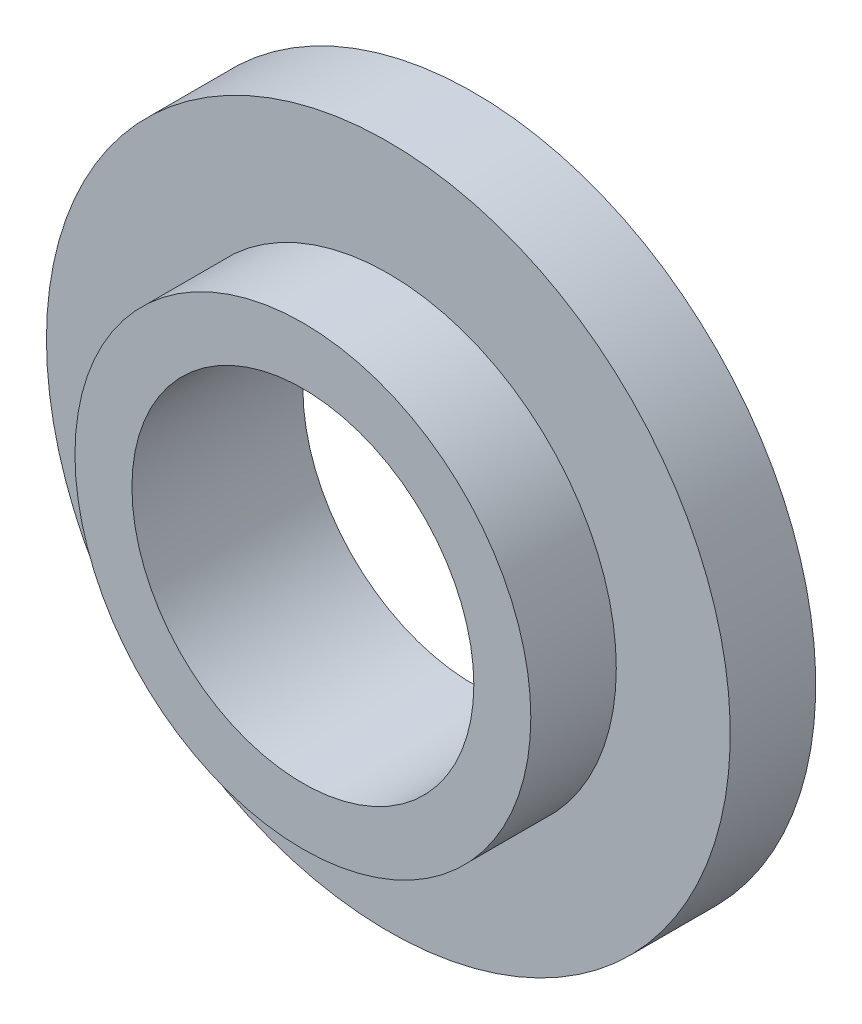
ISO-10303-21;
HEADER;
FILE_DESCRIPTION(('STEP AP214'),'2;1');
FILE_NAME('part.step','',(''),(''),'','','');
FILE_SCHEMA(('AUTOMOTIVE_DESIGN { 1 0 10303 214 1 1 1 1 }'));
ENDSEC;
DATA;
#1=APPLICATION_CONTEXT('core data for automotive mechanical design processes');
#2=APPLICATION_PROTOCOL_DEFINITION('international standard','automotive_design',2000,#1);
#3=PRODUCT_CONTEXT('',#1,'mechanical');
#4=PRODUCT('Part','Part','',(#3));
#5=PRODUCT_RELATED_PRODUCT_CATEGORY('part','',(#4));
#6=PRODUCT_DEFINITION_FORMATION('','',#4);
#7=PRODUCT_DEFINITION_CONTEXT('part definition',#1,'design');
#8=PRODUCT_DEFINITION('design','',#6,#7);
#9=PRODUCT_DEFINITION_SHAPE('','',#8);
#10=(LENGTH_UNIT() NAMED_UNIT(*) SI_UNIT(.MILLI.,.METRE.));
#11=(NAMED_UNIT(*) PLANE_ANGLE_UNIT() SI_UNIT($,.RADIAN.));
#12=(NAMED_UNIT(*) SI_UNIT($,.STERADIAN.) SOLID_ANGLE_UNIT());
#13=UNCERTAINTY_MEASURE_WITH_UNIT(LENGTH_MEASURE(1.E-05),#10,'distance_accuracy_value','');
#14=(GEOMETRIC_REPRESENTATION_CONTEXT(3) GLOBAL_UNCERTAINTY_ASSIGNED_CONTEXT((#13)) GLOBAL_UNIT_ASSIGNED_CONTEXT((#10,
#11,#12)) REPRESENTATION_CONTEXT('',''));
#15=CARTESIAN_POINT('',(0.,0.,0.));
#16=DIRECTION('',(0.,0.,1.));
#17=DIRECTION('',(1.,0.,0.));
#18=AXIS2_PLACEMENT_3D('',#15,#16,#17);
#19=CARTESIAN_POINT('',(0.,0.,15.));
#20=DIRECTION('',(0.,0.,-1.));
#21=DIRECTION('',(-1.,0.,0.));
#22=AXIS2_PLACEMENT_3D('',#19,#20,#21);
#23=CYLINDRICAL_SURFACE('',#22,20.);
#24=CARTESIAN_POINT('',(0.,0.,15.));
#25=DIRECTION('',(0.,0.,1.));
#26=DIRECTION('',(1.,0.,0.));
#27=AXIS2_PLACEMENT_3D('',#24,#25,#26);
#28=CIRCLE('',#27,20.);
#29=CARTESIAN_POINT('',(20.,0.,15.));
#30=VERTEX_POINT('',#29);
#31=EDGE_CURVE('E37',#30,#30,#28,.T.);
#32=ORIENTED_EDGE('',*,*,#31,.F.);
#33=EDGE_LOOP('',(#32));
#34=FACE_BOUND('',#33,.T.);
#35=CARTESIAN_POINT('',(0.,0.,7.5));
#36=DIRECTION('',(0.,0.,-1.));
#37=DIRECTION('',(-1.,0.,0.));
#38=AXIS2_PLACEMENT_3D('',#35,#36,#37);
#39=CIRCLE('',#38,20.);
#40=CARTESIAN_POINT('',(-20.,0.,7.5));
#41=VERTEX_POINT('',#40);
#42=EDGE_CURVE('E10',#41,#41,#39,.T.);
#43=ORIENTED_EDGE('',*,*,#42,.F.);
#44=EDGE_LOOP('',(#43));
#45=FACE_BOUND('',#44,.T.);
#46=ADVANCED_FACE('F31',(#34,#45),#23,.T.);
#47=CARTESIAN_POINT('',(0.,0.,15.));
#48=DIRECTION('',(0.,0.,1.));
#49=DIRECTION('',(1.,0.,0.));
#50=AXIS2_PLACEMENT_3D('',#47,#48,#49);
#51=PLANE('',#50);
#52=ORIENTED_EDGE('',*,*,#31,.T.);
#53=EDGE_LOOP('',(#52));
#54=FACE_BOUND('',#53,.T.);
#55=CARTESIAN_POINT('',(0.,0.,15.));
#56=DIRECTION('',(0.,0.,1.));
#57=DIRECTION('',(1.,0.,0.));
#58=AXIS2_PLACEMENT_3D('',#55,#56,#57);
#59=CIRCLE('',#58,15.);
#60=CARTESIAN_POINT('',(15.,0.,15.));
#61=VERTEX_POINT('',#60);
#62=EDGE_CURVE('E41',#61,#61,#59,.T.);
#63=ORIENTED_EDGE('',*,*,#62,.F.);
#64=EDGE_LOOP('',(#63));
#65=FACE_BOUND('',#64,.T.);
#66=ADVANCED_FACE('F69',(#54,#65),#51,.T.);
#67=CARTESIAN_POINT('',(0.,0.,0.));
#68=DIRECTION('',(0.,0.,1.));
#69=DIRECTION('',(1.,0.,0.));
#70=AXIS2_PLACEMENT_3D('',#67,#68,#69);
#71=PLANE('',#70);
#72=CARTESIAN_POINT('',(0.,0.,0.));
#73=DIRECTION('',(0.,0.,1.));
#74=DIRECTION('',(1.,0.,0.));
#75=AXIS2_PLACEMENT_3D('',#72,#73,#74);
#76=CIRCLE('',#75,15.);
#77=CARTESIAN_POINT('',(15.,0.,0.));
#78=VERTEX_POINT('',#77);
#79=EDGE_CURVE('E45',#78,#78,#76,.T.);
#80=ORIENTED_EDGE('',*,*,#79,.T.);
#81=EDGE_LOOP('',(#80));
#82=FACE_BOUND('',#81,.T.);
#83=CARTESIAN_POINT('',(0.,0.,0.));
#84=DIRECTION('',(0.,0.,-1.));
#85=DIRECTION('',(-1.,0.,0.));
#86=AXIS2_PLACEMENT_3D('',#83,#84,#85);
#87=CIRCLE('',#86,30.);
#88=CARTESIAN_POINT('',(-30.,0.,0.));
#89=VERTEX_POINT('',#88);
#90=EDGE_CURVE('E51',#89,#89,#87,.T.);
#91=ORIENTED_EDGE('',*,*,#90,.T.);
#92=EDGE_LOOP('',(#91));
#93=FACE_BOUND('',#92,.T.);
#94=ADVANCED_FACE('F74',(#82,#93),#71,.F.);
#95=CARTESIAN_POINT('',(0.,0.,15.));
#96=DIRECTION('',(0.,0.,-1.));
#97=DIRECTION('',(-1.,0.,0.));
#98=AXIS2_PLACEMENT_3D('',#95,#96,#97);
#99=CYLINDRICAL_SURFACE('',#98,15.);
#100=ORIENTED_EDGE('',*,*,#62,.T.);
#101=EDGE_LOOP('',(#100));
#102=FACE_BOUND('',#101,.T.);
#103=ORIENTED_EDGE('',*,*,#79,.F.);
#104=EDGE_LOOP('',(#103));
#105=FACE_BOUND('',#104,.T.);
#106=ADVANCED_FACE('F66',(#102,#105),#99,.F.);
#107=CARTESIAN_POINT('',(0.,0.,7.5));
#108=DIRECTION('',(0.,0.,-1.));
#109=DIRECTION('',(-1.,0.,0.));
#110=AXIS2_PLACEMENT_3D('',#107,#108,#109);
#111=CYLINDRICAL_SURFACE('',#110,30.);
#112=CARTESIAN_POINT('',(0.,0.,7.5));
#113=DIRECTION('',(0.,0.,-1.));
#114=DIRECTION('',(-1.,0.,0.));
#115=AXIS2_PLACEMENT_3D('',#112,#113,#114);
#116=CIRCLE('',#115,30.);
#117=CARTESIAN_POINT('',(-30.,0.,7.5));
#118=VERTEX_POINT('',#117);
#119=EDGE_CURVE('E49',#118,#118,#116,.T.);
#120=ORIENTED_EDGE('',*,*,#119,.T.);
#121=EDGE_LOOP('',(#120));
#122=FACE_BOUND('',#121,.T.);
#123=ORIENTED_EDGE('',*,*,#90,.F.);
#124=EDGE_LOOP('',(#123));
#125=FACE_BOUND('',#124,.T.);
#126=ADVANCED_FACE('F57',(#122,#125),#111,.T.);
#127=CARTESIAN_POINT('',(0.,0.,7.5));
#128=DIRECTION('',(0.,0.,-1.));
#129=DIRECTION('',(-1.,0.,0.));
#130=AXIS2_PLACEMENT_3D('',#127,#128,#129);
#131=PLANE('',#130);
#132=ORIENTED_EDGE('',*,*,#42,.T.);
#133=EDGE_LOOP('',(#132));
#134=FACE_BOUND('',#133,.T.);
#135=ORIENTED_EDGE('',*,*,#119,.F.);
#136=EDGE_LOOP('',(#135));
#137=FACE_BOUND('',#136,.T.);
#138=ADVANCED_FACE('F60',(#134,#137),#131,.F.);
#139=CLOSED_SHELL('',(#46,#66,#94,#106,#126,#138));
#140=MANIFOLD_SOLID_BREP('B2',#139);
#141=ADVANCED_BREP_SHAPE_REPRESENTATION('',(#18,#140),#14);
#142=SHAPE_DEFINITION_REPRESENTATION(#9,#141);
ENDSEC;
END-ISO-10303-21;
